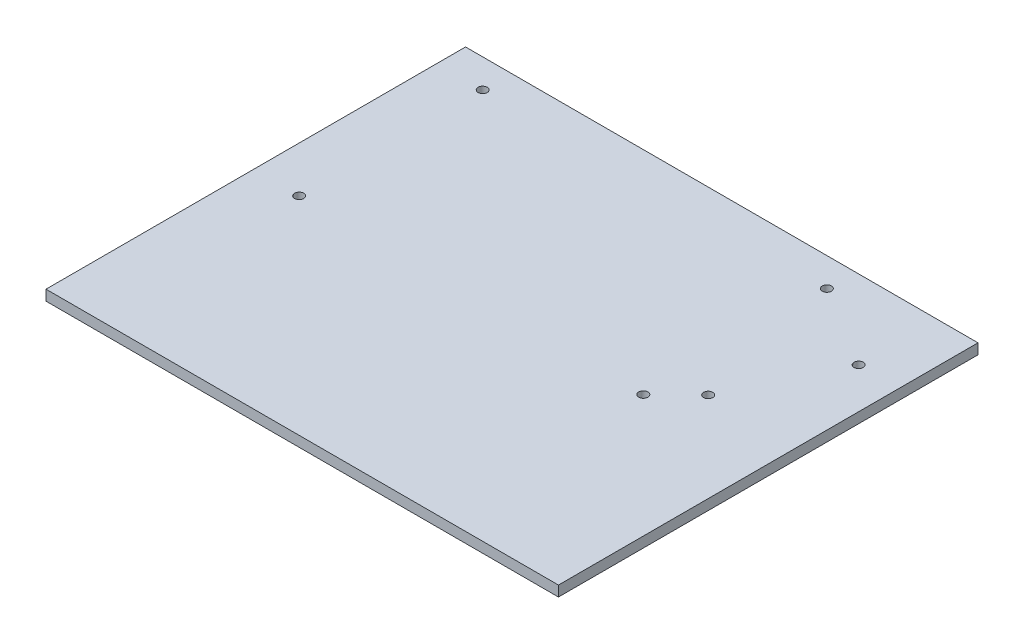
ISO-10303-21;
HEADER;
FILE_DESCRIPTION(('STEP AP214'),'2;1');
FILE_NAME('part.step','',(''),(''),'','','');
FILE_SCHEMA(('AUTOMOTIVE_DESIGN { 1 0 10303 214 1 1 1 1 }'));
ENDSEC;
DATA;
#1=APPLICATION_CONTEXT('core data for automotive mechanical design processes');
#2=APPLICATION_PROTOCOL_DEFINITION('international standard','automotive_design',2000,#1);
#3=PRODUCT_CONTEXT('',#1,'mechanical');
#4=PRODUCT('Part','Part','',(#3));
#5=PRODUCT_RELATED_PRODUCT_CATEGORY('part','',(#4));
#6=PRODUCT_DEFINITION_FORMATION('','',#4);
#7=PRODUCT_DEFINITION_CONTEXT('part definition',#1,'design');
#8=PRODUCT_DEFINITION('design','',#6,#7);
#9=PRODUCT_DEFINITION_SHAPE('','',#8);
#10=(LENGTH_UNIT() NAMED_UNIT(*) SI_UNIT(.MILLI.,.METRE.));
#11=(NAMED_UNIT(*) PLANE_ANGLE_UNIT() SI_UNIT($,.RADIAN.));
#12=(NAMED_UNIT(*) SI_UNIT($,.STERADIAN.) SOLID_ANGLE_UNIT());
#13=UNCERTAINTY_MEASURE_WITH_UNIT(LENGTH_MEASURE(1.E-05),#10,'distance_accuracy_value','');
#14=(GEOMETRIC_REPRESENTATION_CONTEXT(3) GLOBAL_UNCERTAINTY_ASSIGNED_CONTEXT((#13)) GLOBAL_UNIT_ASSIGNED_CONTEXT((#10,
#11,#12)) REPRESENTATION_CONTEXT('',''));
#15=CARTESIAN_POINT('',(0.,0.,0.));
#16=DIRECTION('',(0.,0.,1.));
#17=DIRECTION('',(1.,0.,0.));
#18=AXIS2_PLACEMENT_3D('',#15,#16,#17);
#19=CARTESIAN_POINT('',(-62.4749219562955,3.175,2.92851196670135));
#20=DIRECTION('',(1.,0.,0.));
#21=DIRECTION('',(0.,0.,-1.));
#22=AXIS2_PLACEMENT_3D('',#19,#20,#21);
#23=PLANE('',#22);
#24=DIRECTION('',(0.,0.,1.));
#25=VECTOR('',#24,1.);
#26=CARTESIAN_POINT('',(-62.4749219562955,0.,2.92851196670135));
#27=LINE('',#26,#25);
#28=CARTESIAN_POINT('',(-62.4749219562955,0.,2.92851196670135));
#29=VERTEX_POINT('',#28);
#30=CARTESIAN_POINT('',(-62.4749219562955,0.,130.928511966701));
#31=VERTEX_POINT('',#30);
#32=EDGE_CURVE('E103',#29,#31,#27,.T.);
#33=ORIENTED_EDGE('',*,*,#32,.T.);
#34=DIRECTION('',(0.,-1.,0.));
#35=VECTOR('',#34,1.);
#36=CARTESIAN_POINT('',(-62.4749219562955,3.175,130.928511966701));
#37=LINE('',#36,#35);
#38=CARTESIAN_POINT('',(-62.4749219562955,3.175,130.928511966701));
#39=VERTEX_POINT('',#38);
#40=EDGE_CURVE('E11',#39,#31,#37,.T.);
#41=ORIENTED_EDGE('',*,*,#40,.F.);
#42=DIRECTION('',(0.,0.,1.));
#43=VECTOR('',#42,1.);
#44=CARTESIAN_POINT('',(-62.4749219562955,3.175,2.92851196670135));
#45=LINE('',#44,#43);
#46=CARTESIAN_POINT('',(-62.4749219562955,3.175,2.92851196670135));
#47=VERTEX_POINT('',#46);
#48=EDGE_CURVE('E90',#47,#39,#45,.T.);
#49=ORIENTED_EDGE('',*,*,#48,.F.);
#50=DIRECTION('',(0.,-1.,0.));
#51=VECTOR('',#50,1.);
#52=CARTESIAN_POINT('',(-62.4749219562955,3.175,2.92851196670135));
#53=LINE('',#52,#51);
#54=EDGE_CURVE('E99',#47,#29,#53,.T.);
#55=ORIENTED_EDGE('',*,*,#54,.T.);
#56=EDGE_LOOP('',(#33,#41,#49,#55));
#57=FACE_BOUND('',#56,.T.);
#58=ADVANCED_FACE('F37',(#57),#23,.F.);
#59=CARTESIAN_POINT('',(-62.4749219562955,3.175,130.928511966701));
#60=DIRECTION('',(0.,0.,-1.));
#61=DIRECTION('',(-1.,0.,0.));
#62=AXIS2_PLACEMENT_3D('',#59,#60,#61);
#63=PLANE('',#62);
#64=DIRECTION('',(1.,0.,0.));
#65=VECTOR('',#64,1.);
#66=CARTESIAN_POINT('',(-62.4749219562955,0.,130.928511966701));
#67=LINE('',#66,#65);
#68=CARTESIAN_POINT('',(93.8750780437045,0.,130.928511966701));
#69=VERTEX_POINT('',#68);
#70=EDGE_CURVE('E94',#31,#69,#67,.T.);
#71=ORIENTED_EDGE('',*,*,#70,.T.);
#72=DIRECTION('',(0.,-1.,0.));
#73=VECTOR('',#72,1.);
#74=CARTESIAN_POINT('',(93.8750780437045,3.175,130.928511966701));
#75=LINE('',#74,#73);
#76=CARTESIAN_POINT('',(93.8750780437045,3.175,130.928511966701));
#77=VERTEX_POINT('',#76);
#78=EDGE_CURVE('E46',#77,#69,#75,.T.);
#79=ORIENTED_EDGE('',*,*,#78,.F.);
#80=DIRECTION('',(1.,0.,0.));
#81=VECTOR('',#80,1.);
#82=CARTESIAN_POINT('',(-62.4749219562955,3.175,130.928511966701));
#83=LINE('',#82,#81);
#84=EDGE_CURVE('E85',#39,#77,#83,.T.);
#85=ORIENTED_EDGE('',*,*,#84,.F.);
#86=ORIENTED_EDGE('',*,*,#40,.T.);
#87=EDGE_LOOP('',(#71,#79,#85,#86));
#88=FACE_BOUND('',#87,.T.);
#89=ADVANCED_FACE('F93',(#88),#63,.F.);
#90=CARTESIAN_POINT('',(93.8750780437045,3.175,2.92851196670135));
#91=DIRECTION('',(-1.,0.,0.));
#92=DIRECTION('',(0.,0.,1.));
#93=AXIS2_PLACEMENT_3D('',#90,#91,#92);
#94=PLANE('',#93);
#95=DIRECTION('',(0.,0.,-1.));
#96=VECTOR('',#95,1.);
#97=CARTESIAN_POINT('',(93.8750780437045,0.,2.92851196670135));
#98=LINE('',#97,#96);
#99=CARTESIAN_POINT('',(93.8750780437045,0.,2.92851196670135));
#100=VERTEX_POINT('',#99);
#101=EDGE_CURVE('E72',#69,#100,#98,.T.);
#102=ORIENTED_EDGE('',*,*,#101,.T.);
#103=DIRECTION('',(0.,-1.,0.));
#104=VECTOR('',#103,1.);
#105=CARTESIAN_POINT('',(93.8750780437045,3.175,2.92851196670135));
#106=LINE('',#105,#104);
#107=CARTESIAN_POINT('',(93.8750780437045,3.175,2.92851196670135));
#108=VERTEX_POINT('',#107);
#109=EDGE_CURVE('E95',#108,#100,#106,.T.);
#110=ORIENTED_EDGE('',*,*,#109,.F.);
#111=DIRECTION('',(0.,0.,-1.));
#112=VECTOR('',#111,1.);
#113=CARTESIAN_POINT('',(93.8750780437045,3.175,2.92851196670135));
#114=LINE('',#113,#112);
#115=EDGE_CURVE('E88',#77,#108,#114,.T.);
#116=ORIENTED_EDGE('',*,*,#115,.F.);
#117=ORIENTED_EDGE('',*,*,#78,.T.);
#118=EDGE_LOOP('',(#102,#110,#116,#117));
#119=FACE_BOUND('',#118,.T.);
#120=ADVANCED_FACE('F97',(#119),#94,.F.);
#121=CARTESIAN_POINT('',(-62.4749219562955,3.175,2.92851196670135));
#122=DIRECTION('',(0.,0.,1.));
#123=DIRECTION('',(1.,0.,0.));
#124=AXIS2_PLACEMENT_3D('',#121,#122,#123);
#125=PLANE('',#124);
#126=DIRECTION('',(-1.,0.,0.));
#127=VECTOR('',#126,1.);
#128=CARTESIAN_POINT('',(-62.4749219562955,0.,2.92851196670135));
#129=LINE('',#128,#127);
#130=EDGE_CURVE('E78',#100,#29,#129,.T.);
#131=ORIENTED_EDGE('',*,*,#130,.T.);
#132=ORIENTED_EDGE('',*,*,#54,.F.);
#133=DIRECTION('',(-1.,0.,0.));
#134=VECTOR('',#133,1.);
#135=CARTESIAN_POINT('',(-62.4749219562955,3.175,2.92851196670135));
#136=LINE('',#135,#134);
#137=EDGE_CURVE('E55',#108,#47,#136,.T.);
#138=ORIENTED_EDGE('',*,*,#137,.F.);
#139=ORIENTED_EDGE('',*,*,#109,.T.);
#140=EDGE_LOOP('',(#131,#132,#138,#139));
#141=FACE_BOUND('',#140,.T.);
#142=ADVANCED_FACE('F161',(#141),#125,.F.);
#143=CARTESIAN_POINT('',(0.,3.175,0.));
#144=DIRECTION('',(0.,1.,0.));
#145=DIRECTION('',(0.,0.,1.));
#146=AXIS2_PLACEMENT_3D('',#143,#144,#145);
#147=PLANE('',#146);
#148=CARTESIAN_POINT('',(-48.5104218048215,3.175,67.6579564707264));
#149=DIRECTION('',(0.,1.,0.));
#150=DIRECTION('',(0.,0.,1.));
#151=AXIS2_PLACEMENT_3D('',#148,#149,#150);
#152=CIRCLE('',#151,1.4);
#153=CARTESIAN_POINT('',(-48.5104218048215,3.175,69.0579564707264));
#154=VERTEX_POINT('',#153);
#155=EDGE_CURVE('E255',#154,#154,#152,.T.);
#156=ORIENTED_EDGE('',*,*,#155,.F.);
#157=EDGE_LOOP('',(#156));
#158=FACE_BOUND('',#157,.T.);
#159=CARTESIAN_POINT('',(-48.5104218048215,3.175,11.6579564707264));
#160=DIRECTION('',(0.,1.,0.));
#161=DIRECTION('',(0.,0.,1.));
#162=AXIS2_PLACEMENT_3D('',#159,#160,#161);
#163=CIRCLE('',#162,1.4);
#164=CARTESIAN_POINT('',(-48.5104218048215,3.175,13.0579564707264));
#165=VERTEX_POINT('',#164);
#166=EDGE_CURVE('E249',#165,#165,#163,.T.);
#167=ORIENTED_EDGE('',*,*,#166,.F.);
#168=EDGE_LOOP('',(#167));
#169=FACE_BOUND('',#168,.T.);
#170=CARTESIAN_POINT('',(56.4895781951785,3.175,11.6579564707264));
#171=DIRECTION('',(0.,1.,0.));
#172=DIRECTION('',(0.,0.,1.));
#173=AXIS2_PLACEMENT_3D('',#170,#171,#172);
#174=CIRCLE('',#173,1.4);
#175=CARTESIAN_POINT('',(56.4895781951785,3.175,13.0579564707264));
#176=VERTEX_POINT('',#175);
#177=EDGE_CURVE('E235',#176,#176,#174,.T.);
#178=ORIENTED_EDGE('',*,*,#177,.F.);
#179=EDGE_LOOP('',(#178));
#180=FACE_BOUND('',#179,.T.);
#181=CARTESIAN_POINT('',(81.4895781951785,3.175,26.9579564707264));
#182=DIRECTION('',(0.,1.,0.));
#183=DIRECTION('',(0.,0.,1.));
#184=AXIS2_PLACEMENT_3D('',#181,#182,#183);
#185=CIRCLE('',#184,1.4);
#186=CARTESIAN_POINT('',(81.4895781951785,3.175,28.3579564707264));
#187=VERTEX_POINT('',#186);
#188=EDGE_CURVE('E248',#187,#187,#185,.T.);
#189=ORIENTED_EDGE('',*,*,#188,.F.);
#190=EDGE_LOOP('',(#189));
#191=FACE_BOUND('',#190,.T.);
#192=CARTESIAN_POINT('',(66.4895781951785,3.175,57.8579564707264));
#193=DIRECTION('',(0.,1.,0.));
#194=DIRECTION('',(0.,0.,1.));
#195=AXIS2_PLACEMENT_3D('',#192,#193,#194);
#196=CIRCLE('',#195,1.4);
#197=CARTESIAN_POINT('',(66.4895781951785,3.175,59.2579564707264));
#198=VERTEX_POINT('',#197);
#199=EDGE_CURVE('E252',#198,#198,#196,.T.);
#200=ORIENTED_EDGE('',*,*,#199,.F.);
#201=EDGE_LOOP('',(#200));
#202=FACE_BOUND('',#201,.T.);
#203=CARTESIAN_POINT('',(56.4895781951786,3.175,67.6579564707264));
#204=DIRECTION('',(0.,1.,0.));
#205=DIRECTION('',(0.,0.,1.));
#206=AXIS2_PLACEMENT_3D('',#203,#204,#205);
#207=CIRCLE('',#206,1.4);
#208=CARTESIAN_POINT('',(56.4895781951786,3.175,69.0579564707264));
#209=VERTEX_POINT('',#208);
#210=EDGE_CURVE('E115',#209,#209,#207,.T.);
#211=ORIENTED_EDGE('',*,*,#210,.F.);
#212=EDGE_LOOP('',(#211));
#213=FACE_BOUND('',#212,.T.);
#214=ORIENTED_EDGE('',*,*,#48,.T.);
#215=ORIENTED_EDGE('',*,*,#84,.T.);
#216=ORIENTED_EDGE('',*,*,#115,.T.);
#217=ORIENTED_EDGE('',*,*,#137,.T.);
#218=EDGE_LOOP('',(#214,#215,#216,#217));
#219=FACE_BOUND('',#218,.T.);
#220=ADVANCED_FACE('F86',(#158,#169,#180,#191,#202,#213,#219),#147,.T.);
#221=CARTESIAN_POINT('',(0.,0.,0.));
#222=DIRECTION('',(0.,1.,0.));
#223=DIRECTION('',(0.,0.,1.));
#224=AXIS2_PLACEMENT_3D('',#221,#222,#223);
#225=PLANE('',#224);
#226=CARTESIAN_POINT('',(-48.5104218048215,0.,67.6579564707264));
#227=DIRECTION('',(0.,1.,0.));
#228=DIRECTION('',(0.,0.,1.));
#229=AXIS2_PLACEMENT_3D('',#226,#227,#228);
#230=CIRCLE('',#229,1.4);
#231=CARTESIAN_POINT('',(-48.5104218048215,0.,69.0579564707264));
#232=VERTEX_POINT('',#231);
#233=EDGE_CURVE('E40',#232,#232,#230,.T.);
#234=ORIENTED_EDGE('',*,*,#233,.T.);
#235=EDGE_LOOP('',(#234));
#236=FACE_BOUND('',#235,.T.);
#237=CARTESIAN_POINT('',(-48.5104218048215,0.,11.6579564707264));
#238=DIRECTION('',(0.,1.,0.));
#239=DIRECTION('',(0.,0.,1.));
#240=AXIS2_PLACEMENT_3D('',#237,#238,#239);
#241=CIRCLE('',#240,1.4);
#242=CARTESIAN_POINT('',(-48.5104218048215,0.,13.0579564707264));
#243=VERTEX_POINT('',#242);
#244=EDGE_CURVE('E123',#243,#243,#241,.T.);
#245=ORIENTED_EDGE('',*,*,#244,.T.);
#246=EDGE_LOOP('',(#245));
#247=FACE_BOUND('',#246,.T.);
#248=CARTESIAN_POINT('',(56.4895781951785,0.,11.6579564707264));
#249=DIRECTION('',(0.,1.,0.));
#250=DIRECTION('',(0.,0.,1.));
#251=AXIS2_PLACEMENT_3D('',#248,#249,#250);
#252=CIRCLE('',#251,1.4);
#253=CARTESIAN_POINT('',(56.4895781951785,0.,13.0579564707264));
#254=VERTEX_POINT('',#253);
#255=EDGE_CURVE('E121',#254,#254,#252,.T.);
#256=ORIENTED_EDGE('',*,*,#255,.T.);
#257=EDGE_LOOP('',(#256));
#258=FACE_BOUND('',#257,.T.);
#259=CARTESIAN_POINT('',(81.4895781951785,0.,26.9579564707264));
#260=DIRECTION('',(0.,1.,0.));
#261=DIRECTION('',(0.,0.,1.));
#262=AXIS2_PLACEMENT_3D('',#259,#260,#261);
#263=CIRCLE('',#262,1.4);
#264=CARTESIAN_POINT('',(81.4895781951785,0.,28.3579564707264));
#265=VERTEX_POINT('',#264);
#266=EDGE_CURVE('E118',#265,#265,#263,.T.);
#267=ORIENTED_EDGE('',*,*,#266,.T.);
#268=EDGE_LOOP('',(#267));
#269=FACE_BOUND('',#268,.T.);
#270=CARTESIAN_POINT('',(66.4895781951785,0.,57.8579564707264));
#271=DIRECTION('',(0.,1.,0.));
#272=DIRECTION('',(0.,0.,1.));
#273=AXIS2_PLACEMENT_3D('',#270,#271,#272);
#274=CIRCLE('',#273,1.4);
#275=CARTESIAN_POINT('',(66.4895781951785,0.,59.2579564707264));
#276=VERTEX_POINT('',#275);
#277=EDGE_CURVE('E114',#276,#276,#274,.T.);
#278=ORIENTED_EDGE('',*,*,#277,.T.);
#279=EDGE_LOOP('',(#278));
#280=FACE_BOUND('',#279,.T.);
#281=CARTESIAN_POINT('',(56.4895781951786,0.,67.6579564707264));
#282=DIRECTION('',(0.,1.,0.));
#283=DIRECTION('',(0.,0.,1.));
#284=AXIS2_PLACEMENT_3D('',#281,#282,#283);
#285=CIRCLE('',#284,1.4);
#286=CARTESIAN_POINT('',(56.4895781951786,0.,69.0579564707264));
#287=VERTEX_POINT('',#286);
#288=EDGE_CURVE('E111',#287,#287,#285,.T.);
#289=ORIENTED_EDGE('',*,*,#288,.T.);
#290=EDGE_LOOP('',(#289));
#291=FACE_BOUND('',#290,.T.);
#292=ORIENTED_EDGE('',*,*,#32,.F.);
#293=ORIENTED_EDGE('',*,*,#130,.F.);
#294=ORIENTED_EDGE('',*,*,#101,.F.);
#295=ORIENTED_EDGE('',*,*,#70,.F.);
#296=EDGE_LOOP('',(#292,#293,#294,#295));
#297=FACE_BOUND('',#296,.T.);
#298=ADVANCED_FACE('F130',(#236,#247,#258,#269,#280,#291,#297),#225,.F.);
#299=CARTESIAN_POINT('',(56.4895781951786,-1.825,67.6579564707264));
#300=DIRECTION('',(0.,1.,0.));
#301=DIRECTION('',(0.,0.,1.));
#302=AXIS2_PLACEMENT_3D('',#299,#300,#301);
#303=CYLINDRICAL_SURFACE('',#302,1.4);
#304=ORIENTED_EDGE('',*,*,#210,.T.);
#305=EDGE_LOOP('',(#304));
#306=FACE_BOUND('',#305,.T.);
#307=ORIENTED_EDGE('',*,*,#288,.F.);
#308=EDGE_LOOP('',(#307));
#309=FACE_BOUND('',#308,.T.);
#310=ADVANCED_FACE('F153',(#306,#309),#303,.F.);
#311=CARTESIAN_POINT('',(66.4895781951785,-1.825,57.8579564707264));
#312=DIRECTION('',(0.,1.,0.));
#313=DIRECTION('',(0.,0.,1.));
#314=AXIS2_PLACEMENT_3D('',#311,#312,#313);
#315=CYLINDRICAL_SURFACE('',#314,1.4);
#316=ORIENTED_EDGE('',*,*,#199,.T.);
#317=EDGE_LOOP('',(#316));
#318=FACE_BOUND('',#317,.T.);
#319=ORIENTED_EDGE('',*,*,#277,.F.);
#320=EDGE_LOOP('',(#319));
#321=FACE_BOUND('',#320,.T.);
#322=ADVANCED_FACE('F159',(#318,#321),#315,.F.);
#323=CARTESIAN_POINT('',(81.4895781951785,-1.825,26.9579564707264));
#324=DIRECTION('',(0.,1.,0.));
#325=DIRECTION('',(0.,0.,1.));
#326=AXIS2_PLACEMENT_3D('',#323,#324,#325);
#327=CYLINDRICAL_SURFACE('',#326,1.4);
#328=ORIENTED_EDGE('',*,*,#188,.T.);
#329=EDGE_LOOP('',(#328));
#330=FACE_BOUND('',#329,.T.);
#331=ORIENTED_EDGE('',*,*,#266,.F.);
#332=EDGE_LOOP('',(#331));
#333=FACE_BOUND('',#332,.T.);
#334=ADVANCED_FACE('F199',(#330,#333),#327,.F.);
#335=CARTESIAN_POINT('',(56.4895781951785,-1.825,11.6579564707264));
#336=DIRECTION('',(0.,1.,0.));
#337=DIRECTION('',(0.,0.,1.));
#338=AXIS2_PLACEMENT_3D('',#335,#336,#337);
#339=CYLINDRICAL_SURFACE('',#338,1.4);
#340=ORIENTED_EDGE('',*,*,#177,.T.);
#341=EDGE_LOOP('',(#340));
#342=FACE_BOUND('',#341,.T.);
#343=ORIENTED_EDGE('',*,*,#255,.F.);
#344=EDGE_LOOP('',(#343));
#345=FACE_BOUND('',#344,.T.);
#346=ADVANCED_FACE('F140',(#342,#345),#339,.F.);
#347=CARTESIAN_POINT('',(-48.5104218048215,-1.825,11.6579564707264));
#348=DIRECTION('',(0.,1.,0.));
#349=DIRECTION('',(0.,0.,1.));
#350=AXIS2_PLACEMENT_3D('',#347,#348,#349);
#351=CYLINDRICAL_SURFACE('',#350,1.4);
#352=ORIENTED_EDGE('',*,*,#166,.T.);
#353=EDGE_LOOP('',(#352));
#354=FACE_BOUND('',#353,.T.);
#355=ORIENTED_EDGE('',*,*,#244,.F.);
#356=EDGE_LOOP('',(#355));
#357=FACE_BOUND('',#356,.T.);
#358=ADVANCED_FACE('F134',(#354,#357),#351,.F.);
#359=CARTESIAN_POINT('',(-48.5104218048215,-1.825,67.6579564707264));
#360=DIRECTION('',(0.,1.,0.));
#361=DIRECTION('',(0.,0.,1.));
#362=AXIS2_PLACEMENT_3D('',#359,#360,#361);
#363=CYLINDRICAL_SURFACE('',#362,1.4);
#364=ORIENTED_EDGE('',*,*,#155,.T.);
#365=EDGE_LOOP('',(#364));
#366=FACE_BOUND('',#365,.T.);
#367=ORIENTED_EDGE('',*,*,#233,.F.);
#368=EDGE_LOOP('',(#367));
#369=FACE_BOUND('',#368,.T.);
#370=ADVANCED_FACE('F132',(#366,#369),#363,.F.);
#371=CLOSED_SHELL('',(#58,#89,#120,#142,#220,#298,#310,#322,#334,#346,#358,#370));
#372=MANIFOLD_SOLID_BREP('B2',#371);
#373=ADVANCED_BREP_SHAPE_REPRESENTATION('',(#18,#372),#14);
#374=SHAPE_DEFINITION_REPRESENTATION(#9,#373);
ENDSEC;
END-ISO-10303-21;
